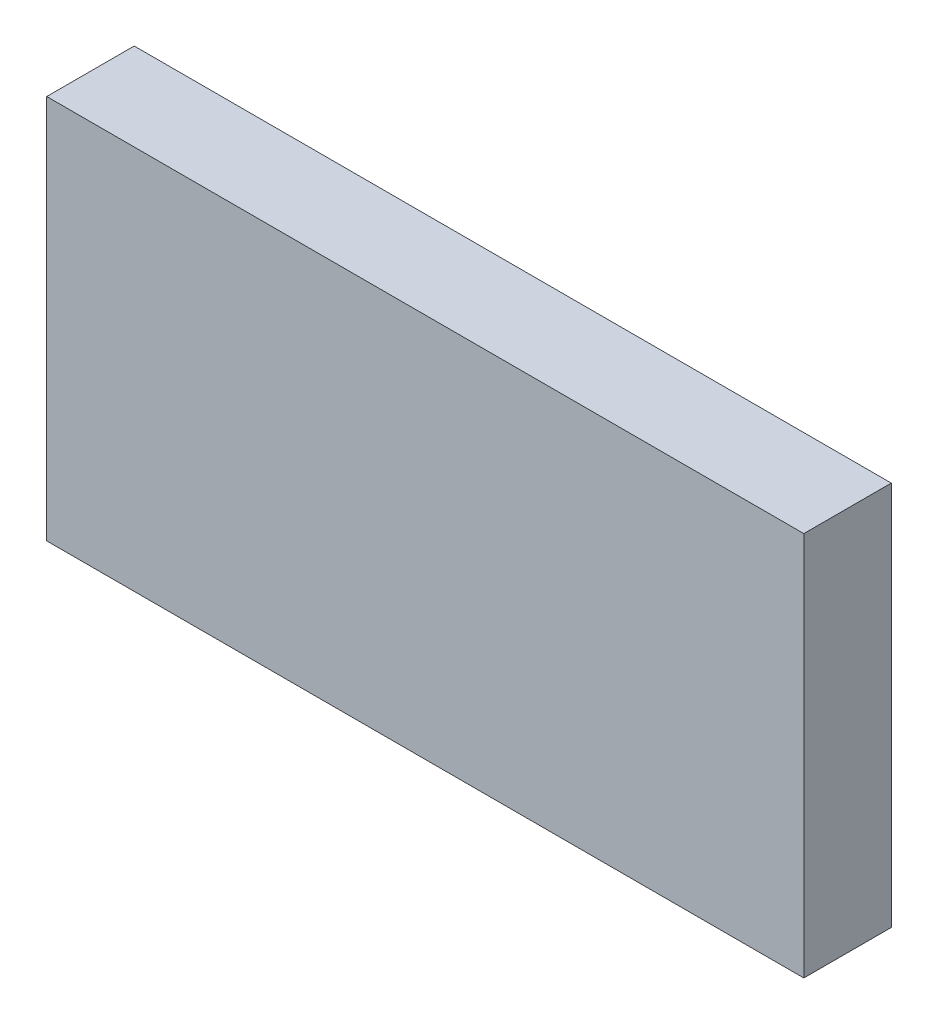
ISO-10303-21;
HEADER;
FILE_DESCRIPTION(('STEP AP214'),'2;1');
FILE_NAME('part.step','',(''),(''),'','','');
FILE_SCHEMA(('AUTOMOTIVE_DESIGN { 1 0 10303 214 1 1 1 1 }'));
ENDSEC;
DATA;
#1=APPLICATION_CONTEXT('core data for automotive mechanical design processes');
#2=APPLICATION_PROTOCOL_DEFINITION('international standard','automotive_design',2000,#1);
#3=PRODUCT_CONTEXT('',#1,'mechanical');
#4=PRODUCT('Part','Part','',(#3));
#5=PRODUCT_RELATED_PRODUCT_CATEGORY('part','',(#4));
#6=PRODUCT_DEFINITION_FORMATION('','',#4);
#7=PRODUCT_DEFINITION_CONTEXT('part definition',#1,'design');
#8=PRODUCT_DEFINITION('design','',#6,#7);
#9=PRODUCT_DEFINITION_SHAPE('','',#8);
#10=(LENGTH_UNIT() NAMED_UNIT(*) SI_UNIT(.MILLI.,.METRE.));
#11=(NAMED_UNIT(*) PLANE_ANGLE_UNIT() SI_UNIT($,.RADIAN.));
#12=(NAMED_UNIT(*) SI_UNIT($,.STERADIAN.) SOLID_ANGLE_UNIT());
#13=UNCERTAINTY_MEASURE_WITH_UNIT(LENGTH_MEASURE(1.E-05),#10,'distance_accuracy_value','');
#14=(GEOMETRIC_REPRESENTATION_CONTEXT(3) GLOBAL_UNCERTAINTY_ASSIGNED_CONTEXT((#13)) GLOBAL_UNIT_ASSIGNED_CONTEXT((#10,
#11,#12)) REPRESENTATION_CONTEXT('',''));
#15=CARTESIAN_POINT('',(0.,0.,0.));
#16=DIRECTION('',(0.,0.,1.));
#17=DIRECTION('',(1.,0.,0.));
#18=AXIS2_PLACEMENT_3D('',#15,#16,#17);
#19=CARTESIAN_POINT('',(0.5795,0.98,0.));
#20=DIRECTION('',(1.,0.,0.));
#21=DIRECTION('',(0.,0.,1.));
#22=AXIS2_PLACEMENT_3D('',#19,#20,#21);
#23=PLANE('',#22);
#24=DIRECTION('',(0.,1.,0.));
#25=VECTOR('',#24,1.);
#26=CARTESIAN_POINT('',(0.5795,0.98,0.1));
#27=LINE('',#26,#25);
#28=CARTESIAN_POINT('',(0.5795,0.98,0.1));
#29=VERTEX_POINT('',#28);
#30=CARTESIAN_POINT('',(0.5795,1.42,0.1));
#31=VERTEX_POINT('',#30);
#32=EDGE_CURVE('E11',#29,#31,#27,.T.);
#33=ORIENTED_EDGE('',*,*,#32,.T.);
#34=DIRECTION('',(0.,0.,1.));
#35=VECTOR('',#34,1.);
#36=CARTESIAN_POINT('',(0.5795,1.42,0.));
#37=LINE('',#36,#35);
#38=CARTESIAN_POINT('',(0.5795,1.42,0.));
#39=VERTEX_POINT('',#38);
#40=EDGE_CURVE('E24',#39,#31,#37,.T.);
#41=ORIENTED_EDGE('',*,*,#40,.F.);
#42=DIRECTION('',(0.,1.,0.));
#43=VECTOR('',#42,1.);
#44=CARTESIAN_POINT('',(0.5795,0.98,0.));
#45=LINE('',#44,#43);
#46=CARTESIAN_POINT('',(0.5795,0.98,0.));
#47=VERTEX_POINT('',#46);
#48=EDGE_CURVE('E86',#47,#39,#45,.T.);
#49=ORIENTED_EDGE('',*,*,#48,.F.);
#50=DIRECTION('',(0.,0.,1.));
#51=VECTOR('',#50,1.);
#52=CARTESIAN_POINT('',(0.5795,0.98,0.));
#53=LINE('',#52,#51);
#54=EDGE_CURVE('E36',#47,#29,#53,.T.);
#55=ORIENTED_EDGE('',*,*,#54,.T.);
#56=EDGE_LOOP('',(#33,#41,#49,#55));
#57=FACE_BOUND('',#56,.T.);
#58=ADVANCED_FACE('F17',(#57),#23,.F.);
#59=CARTESIAN_POINT('',(1.445,0.98,0.));
#60=DIRECTION('',(1.,0.,0.));
#61=DIRECTION('',(0.,0.,1.));
#62=AXIS2_PLACEMENT_3D('',#59,#60,#61);
#63=PLANE('',#62);
#64=DIRECTION('',(0.,0.,1.));
#65=VECTOR('',#64,1.);
#66=CARTESIAN_POINT('',(1.445,0.98,0.));
#67=LINE('',#66,#65);
#68=CARTESIAN_POINT('',(1.445,0.98,0.));
#69=VERTEX_POINT('',#68);
#70=CARTESIAN_POINT('',(1.445,0.98,0.1));
#71=VERTEX_POINT('',#70);
#72=EDGE_CURVE('E83',#69,#71,#67,.T.);
#73=ORIENTED_EDGE('',*,*,#72,.F.);
#74=DIRECTION('',(0.,1.,0.));
#75=VECTOR('',#74,1.);
#76=CARTESIAN_POINT('',(1.445,0.98,0.));
#77=LINE('',#76,#75);
#78=CARTESIAN_POINT('',(1.445,1.42,0.));
#79=VERTEX_POINT('',#78);
#80=EDGE_CURVE('E63',#69,#79,#77,.T.);
#81=ORIENTED_EDGE('',*,*,#80,.T.);
#82=DIRECTION('',(0.,0.,1.));
#83=VECTOR('',#82,1.);
#84=CARTESIAN_POINT('',(1.445,1.42,0.));
#85=LINE('',#84,#83);
#86=CARTESIAN_POINT('',(1.445,1.42,0.1));
#87=VERTEX_POINT('',#86);
#88=EDGE_CURVE('E57',#79,#87,#85,.T.);
#89=ORIENTED_EDGE('',*,*,#88,.T.);
#90=DIRECTION('',(0.,1.,0.));
#91=VECTOR('',#90,1.);
#92=CARTESIAN_POINT('',(1.445,0.98,0.1));
#93=LINE('',#92,#91);
#94=EDGE_CURVE('E60',#71,#87,#93,.T.);
#95=ORIENTED_EDGE('',*,*,#94,.F.);
#96=EDGE_LOOP('',(#73,#81,#89,#95));
#97=FACE_BOUND('',#96,.T.);
#98=ADVANCED_FACE('F59',(#97),#63,.T.);
#99=CARTESIAN_POINT('',(0.5795,0.98,0.));
#100=DIRECTION('',(0.,1.,0.));
#101=DIRECTION('',(0.,0.,1.));
#102=AXIS2_PLACEMENT_3D('',#99,#100,#101);
#103=PLANE('',#102);
#104=ORIENTED_EDGE('',*,*,#72,.T.);
#105=DIRECTION('',(1.,0.,0.));
#106=VECTOR('',#105,1.);
#107=CARTESIAN_POINT('',(0.5795,0.98,0.1));
#108=LINE('',#107,#106);
#109=EDGE_CURVE('E71',#29,#71,#108,.T.);
#110=ORIENTED_EDGE('',*,*,#109,.F.);
#111=ORIENTED_EDGE('',*,*,#54,.F.);
#112=DIRECTION('',(1.,0.,0.));
#113=VECTOR('',#112,1.);
#114=CARTESIAN_POINT('',(0.5795,0.98,0.));
#115=LINE('',#114,#113);
#116=EDGE_CURVE('E76',#47,#69,#115,.T.);
#117=ORIENTED_EDGE('',*,*,#116,.T.);
#118=EDGE_LOOP('',(#104,#110,#111,#117));
#119=FACE_BOUND('',#118,.T.);
#120=ADVANCED_FACE('F91',(#119),#103,.F.);
#121=CARTESIAN_POINT('',(0.5795,1.42,0.));
#122=DIRECTION('',(0.,1.,0.));
#123=DIRECTION('',(0.,0.,1.));
#124=AXIS2_PLACEMENT_3D('',#121,#122,#123);
#125=PLANE('',#124);
#126=DIRECTION('',(1.,0.,0.));
#127=VECTOR('',#126,1.);
#128=CARTESIAN_POINT('',(0.5795,1.42,0.));
#129=LINE('',#128,#127);
#130=EDGE_CURVE('E74',#39,#79,#129,.T.);
#131=ORIENTED_EDGE('',*,*,#130,.F.);
#132=ORIENTED_EDGE('',*,*,#40,.T.);
#133=DIRECTION('',(1.,0.,0.));
#134=VECTOR('',#133,1.);
#135=CARTESIAN_POINT('',(0.5795,1.42,0.1));
#136=LINE('',#135,#134);
#137=EDGE_CURVE('E69',#31,#87,#136,.T.);
#138=ORIENTED_EDGE('',*,*,#137,.T.);
#139=ORIENTED_EDGE('',*,*,#88,.F.);
#140=EDGE_LOOP('',(#131,#132,#138,#139));
#141=FACE_BOUND('',#140,.T.);
#142=ADVANCED_FACE('F73',(#141),#125,.T.);
#143=CARTESIAN_POINT('',(0.5795,0.98,0.));
#144=DIRECTION('',(0.,0.,1.));
#145=DIRECTION('',(1.,0.,0.));
#146=AXIS2_PLACEMENT_3D('',#143,#144,#145);
#147=PLANE('',#146);
#148=ORIENTED_EDGE('',*,*,#130,.T.);
#149=ORIENTED_EDGE('',*,*,#80,.F.);
#150=ORIENTED_EDGE('',*,*,#116,.F.);
#151=ORIENTED_EDGE('',*,*,#48,.T.);
#152=EDGE_LOOP('',(#148,#149,#150,#151));
#153=FACE_BOUND('',#152,.T.);
#154=ADVANCED_FACE('F89',(#153),#147,.F.);
#155=CARTESIAN_POINT('',(0.5795,0.98,0.1));
#156=DIRECTION('',(0.,0.,1.));
#157=DIRECTION('',(1.,0.,0.));
#158=AXIS2_PLACEMENT_3D('',#155,#156,#157);
#159=PLANE('',#158);
#160=ORIENTED_EDGE('',*,*,#32,.F.);
#161=ORIENTED_EDGE('',*,*,#109,.T.);
#162=ORIENTED_EDGE('',*,*,#94,.T.);
#163=ORIENTED_EDGE('',*,*,#137,.F.);
#164=EDGE_LOOP('',(#160,#161,#162,#163));
#165=FACE_BOUND('',#164,.T.);
#166=ADVANCED_FACE('F68',(#165),#159,.T.);
#167=CLOSED_SHELL('',(#58,#98,#120,#142,#154,#166));
#168=MANIFOLD_SOLID_BREP('B1',#167);
#169=ADVANCED_BREP_SHAPE_REPRESENTATION('',(#18,#168),#14);
#170=SHAPE_DEFINITION_REPRESENTATION(#9,#169);
ENDSEC;
END-ISO-10303-21;
